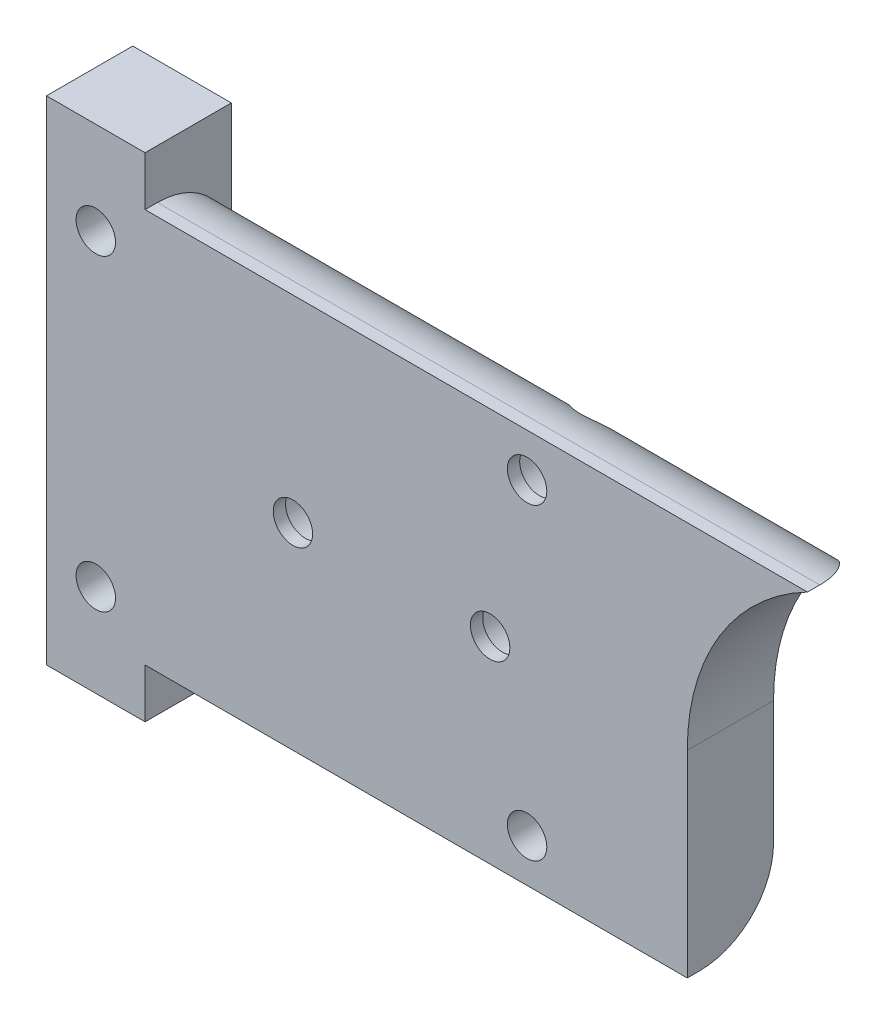
ISO-10303-21;
HEADER;
FILE_DESCRIPTION(('STEP AP214'),'2;1');
FILE_NAME('part.step','',(''),(''),'','','');
FILE_SCHEMA(('AUTOMOTIVE_DESIGN { 1 0 10303 214 1 1 1 1 }'));
ENDSEC;
DATA;
#1=APPLICATION_CONTEXT('core data for automotive mechanical design processes');
#2=APPLICATION_PROTOCOL_DEFINITION('international standard','automotive_design',2000,#1);
#3=PRODUCT_CONTEXT('',#1,'mechanical');
#4=PRODUCT('Part','Part','',(#3));
#5=PRODUCT_RELATED_PRODUCT_CATEGORY('part','',(#4));
#6=PRODUCT_DEFINITION_FORMATION('','',#4);
#7=PRODUCT_DEFINITION_CONTEXT('part definition',#1,'design');
#8=PRODUCT_DEFINITION('design','',#6,#7);
#9=PRODUCT_DEFINITION_SHAPE('','',#8);
#10=(LENGTH_UNIT() NAMED_UNIT(*) SI_UNIT(.MILLI.,.METRE.));
#11=(NAMED_UNIT(*) PLANE_ANGLE_UNIT() SI_UNIT($,.RADIAN.));
#12=(NAMED_UNIT(*) SI_UNIT($,.STERADIAN.) SOLID_ANGLE_UNIT());
#13=UNCERTAINTY_MEASURE_WITH_UNIT(LENGTH_MEASURE(1.E-05),#10,'distance_accuracy_value','');
#14=(GEOMETRIC_REPRESENTATION_CONTEXT(3) GLOBAL_UNCERTAINTY_ASSIGNED_CONTEXT((#13)) GLOBAL_UNIT_ASSIGNED_CONTEXT((#10,
#11,#12)) REPRESENTATION_CONTEXT('',''));
#15=CARTESIAN_POINT('',(0.,0.,0.));
#16=DIRECTION('',(0.,0.,1.));
#17=DIRECTION('',(1.,0.,0.));
#18=AXIS2_PLACEMENT_3D('',#15,#16,#17);
#19=CARTESIAN_POINT('',(0.,0.,0.));
#20=DIRECTION('',(0.,0.,1.));
#21=DIRECTION('',(1.,0.,0.));
#22=AXIS2_PLACEMENT_3D('',#19,#20,#21);
#23=PLANE('',#22);
#24=DIRECTION('',(0.,-1.,0.));
#25=VECTOR('',#24,1.);
#26=CARTESIAN_POINT('',(36.1612558937557,0.,0.));
#27=LINE('',#26,#25);
#28=CARTESIAN_POINT('',(36.1612558937557,0.,0.));
#29=VERTEX_POINT('',#28);
#30=CARTESIAN_POINT('',(36.1612558937557,-5.,0.));
#31=VERTEX_POINT('',#30);
#32=EDGE_CURVE('E301',#29,#31,#27,.T.);
#33=ORIENTED_EDGE('',*,*,#32,.T.);
#34=DIRECTION('',(1.,0.,0.));
#35=VECTOR('',#34,1.);
#36=CARTESIAN_POINT('',(0.,-5.,0.));
#37=LINE('',#36,#35);
#38=CARTESIAN_POINT('',(14.1612558936984,-5.,0.));
#39=VERTEX_POINT('',#38);
#40=EDGE_CURVE('E181',#31,#39,#37,.F.);
#41=ORIENTED_EDGE('',*,*,#40,.T.);
#42=DIRECTION('',(0.,1.,0.));
#43=VECTOR('',#42,1.);
#44=CARTESIAN_POINT('',(14.1612558936984,0.,0.));
#45=LINE('',#44,#43);
#46=CARTESIAN_POINT('',(14.1612558936984,-10.,0.));
#47=VERTEX_POINT('',#46);
#48=EDGE_CURVE('E305',#47,#39,#45,.T.);
#49=ORIENTED_EDGE('',*,*,#48,.F.);
#50=DIRECTION('',(1.,0.,0.));
#51=VECTOR('',#50,1.);
#52=CARTESIAN_POINT('',(0.,-10.,0.));
#53=LINE('',#52,#51);
#54=CARTESIAN_POINT('',(10.1612558936984,-10.,0.));
#55=VERTEX_POINT('',#54);
#56=EDGE_CURVE('E307',#55,#47,#53,.T.);
#57=ORIENTED_EDGE('',*,*,#56,.F.);
#58=DIRECTION('',(0.,-1.,0.));
#59=VECTOR('',#58,1.);
#60=CARTESIAN_POINT('',(10.1612558936984,0.,0.));
#61=LINE('',#60,#59);
#62=CARTESIAN_POINT('',(10.1612558936984,10.,0.));
#63=VERTEX_POINT('',#62);
#64=EDGE_CURVE('E151',#63,#55,#61,.T.);
#65=ORIENTED_EDGE('',*,*,#64,.F.);
#66=DIRECTION('',(1.,0.,0.));
#67=VECTOR('',#66,1.);
#68=CARTESIAN_POINT('',(0.,10.,0.));
#69=LINE('',#68,#67);
#70=CARTESIAN_POINT('',(14.1612558936984,10.,0.));
#71=VERTEX_POINT('',#70);
#72=EDGE_CURVE('E147',#63,#71,#69,.T.);
#73=ORIENTED_EDGE('',*,*,#72,.T.);
#74=DIRECTION('',(0.,-1.,0.));
#75=VECTOR('',#74,1.);
#76=CARTESIAN_POINT('',(14.1612558936984,0.,0.));
#77=LINE('',#76,#75);
#78=CARTESIAN_POINT('',(14.1612558936984,5.,0.));
#79=VERTEX_POINT('',#78);
#80=EDGE_CURVE('E265',#71,#79,#77,.T.);
#81=ORIENTED_EDGE('',*,*,#80,.T.);
#82=DIRECTION('',(1.,0.,0.));
#83=VECTOR('',#82,1.);
#84=CARTESIAN_POINT('',(41.0381502681381,5.,0.));
#85=LINE('',#84,#83);
#86=CARTESIAN_POINT('',(29.6612558937558,4.99999999999979,0.));
#87=VERTEX_POINT('',#86);
#88=EDGE_CURVE('E176',#79,#87,#85,.T.);
#89=ORIENTED_EDGE('',*,*,#88,.T.);
#90=DIRECTION('',(1.,0.,0.));
#91=VECTOR('',#90,1.);
#92=CARTESIAN_POINT('',(41.0381502681381,5.,0.));
#93=LINE('',#92,#91);
#94=CARTESIAN_POINT('',(37.6779411202078,5.,0.));
#95=VERTEX_POINT('',#94);
#96=EDGE_CURVE('E179',#87,#95,#93,.T.);
#97=ORIENTED_EDGE('',*,*,#96,.T.);
#98=CARTESIAN_POINT('',(45.1612558937557,0.,0.));
#99=DIRECTION('',(0.,0.,1.));
#100=DIRECTION('',(1.,0.,0.));
#101=AXIS2_PLACEMENT_3D('',#98,#99,#100);
#102=CIRCLE('',#101,9.);
#103=EDGE_CURVE('E271',#95,#29,#102,.T.);
#104=ORIENTED_EDGE('',*,*,#103,.T.);
#105=EDGE_LOOP('',(#33,#41,#49,#57,#65,#73,#81,#89,#97,#104));
#106=FACE_BOUND('',#105,.T.);
#107=CARTESIAN_POINT('',(12.1612558937557,6.25,0.));
#108=DIRECTION('',(0.,0.,1.));
#109=DIRECTION('',(1.,0.,0.));
#110=AXIS2_PLACEMENT_3D('',#107,#108,#109);
#111=CIRCLE('',#110,0.800000000000001);
#112=CARTESIAN_POINT('',(12.9612558937557,6.25,0.));
#113=VERTEX_POINT('',#112);
#114=EDGE_CURVE('E326',#113,#113,#111,.T.);
#115=ORIENTED_EDGE('',*,*,#114,.T.);
#116=EDGE_LOOP('',(#115));
#117=FACE_BOUND('',#116,.T.);
#118=CARTESIAN_POINT('',(12.1612558937557,-6.25,0.));
#119=DIRECTION('',(0.,0.,1.));
#120=DIRECTION('',(1.,0.,0.));
#121=AXIS2_PLACEMENT_3D('',#118,#119,#120);
#122=CIRCLE('',#121,0.800000000000001);
#123=CARTESIAN_POINT('',(12.9612558937557,-6.25,0.));
#124=VERTEX_POINT('',#123);
#125=EDGE_CURVE('E335',#124,#124,#122,.T.);
#126=ORIENTED_EDGE('',*,*,#125,.T.);
#127=EDGE_LOOP('',(#126));
#128=FACE_BOUND('',#127,.T.);
#129=CARTESIAN_POINT('',(20.1612558937557,0.,0.));
#130=DIRECTION('',(0.,0.,1.));
#131=DIRECTION('',(1.,0.,0.));
#132=AXIS2_PLACEMENT_3D('',#129,#130,#131);
#133=CIRCLE('',#132,1.25);
#134=CARTESIAN_POINT('',(21.4112558937557,0.,0.));
#135=VERTEX_POINT('',#134);
#136=EDGE_CURVE('E169',#135,#135,#133,.T.);
#137=ORIENTED_EDGE('',*,*,#136,.T.);
#138=EDGE_LOOP('',(#137));
#139=FACE_BOUND('',#138,.T.);
#140=CARTESIAN_POINT('',(28.1612558937557,0.,0.));
#141=DIRECTION('',(0.,0.,1.));
#142=DIRECTION('',(1.,0.,0.));
#143=AXIS2_PLACEMENT_3D('',#140,#141,#142);
#144=CIRCLE('',#143,1.25);
#145=CARTESIAN_POINT('',(29.4112558937557,0.,0.));
#146=VERTEX_POINT('',#145);
#147=EDGE_CURVE('E353',#146,#146,#144,.T.);
#148=ORIENTED_EDGE('',*,*,#147,.T.);
#149=EDGE_LOOP('',(#148));
#150=FACE_BOUND('',#149,.T.);
#151=ADVANCED_FACE('F35',(#106,#117,#128,#139,#150),#23,.F.);
#152=CARTESIAN_POINT('',(0.,0.,3.5));
#153=DIRECTION('',(0.,0.,1.));
#154=DIRECTION('',(1.,0.,0.));
#155=AXIS2_PLACEMENT_3D('',#152,#153,#154);
#156=PLANE('',#155);
#157=CARTESIAN_POINT('',(29.6612558937557,-6.25,3.5));
#158=DIRECTION('',(0.,0.,1.));
#159=DIRECTION('',(1.,0.,0.));
#160=AXIS2_PLACEMENT_3D('',#157,#158,#159);
#161=CIRCLE('',#160,0.800000000000002);
#162=CARTESIAN_POINT('',(30.4612558937557,-6.25,3.5));
#163=VERTEX_POINT('',#162);
#164=EDGE_CURVE('E224',#163,#163,#161,.T.);
#165=ORIENTED_EDGE('',*,*,#164,.F.);
#166=EDGE_LOOP('',(#165));
#167=FACE_BOUND('',#166,.T.);
#168=CARTESIAN_POINT('',(12.1612558937557,-6.25,3.5));
#169=DIRECTION('',(0.,0.,1.));
#170=DIRECTION('',(1.,0.,0.));
#171=AXIS2_PLACEMENT_3D('',#168,#169,#170);
#172=CIRCLE('',#171,0.800000000000001);
#173=CARTESIAN_POINT('',(12.9612558937557,-6.25,3.5));
#174=VERTEX_POINT('',#173);
#175=EDGE_CURVE('E334',#174,#174,#172,.T.);
#176=ORIENTED_EDGE('',*,*,#175,.F.);
#177=EDGE_LOOP('',(#176));
#178=FACE_BOUND('',#177,.T.);
#179=CARTESIAN_POINT('',(12.1612558937557,6.25,3.5));
#180=DIRECTION('',(0.,0.,1.));
#181=DIRECTION('',(1.,0.,0.));
#182=AXIS2_PLACEMENT_3D('',#179,#180,#181);
#183=CIRCLE('',#182,0.800000000000001);
#184=CARTESIAN_POINT('',(12.9612558937557,6.25,3.5));
#185=VERTEX_POINT('',#184);
#186=EDGE_CURVE('E312',#185,#185,#183,.T.);
#187=ORIENTED_EDGE('',*,*,#186,.F.);
#188=EDGE_LOOP('',(#187));
#189=FACE_BOUND('',#188,.T.);
#190=DIRECTION('',(0.,-1.,0.));
#191=VECTOR('',#190,1.);
#192=CARTESIAN_POINT('',(10.1612558936984,0.,3.5));
#193=LINE('',#192,#191);
#194=CARTESIAN_POINT('',(10.1612558936984,10.,3.5));
#195=VERTEX_POINT('',#194);
#196=CARTESIAN_POINT('',(10.1612558936984,-10.,3.5));
#197=VERTEX_POINT('',#196);
#198=EDGE_CURVE('E137',#195,#197,#193,.T.);
#199=ORIENTED_EDGE('',*,*,#198,.T.);
#200=DIRECTION('',(1.,0.,0.));
#201=VECTOR('',#200,1.);
#202=CARTESIAN_POINT('',(0.,-10.,3.5));
#203=LINE('',#202,#201);
#204=CARTESIAN_POINT('',(14.1612558936984,-10.,3.5));
#205=VERTEX_POINT('',#204);
#206=EDGE_CURVE('E126',#197,#205,#203,.T.);
#207=ORIENTED_EDGE('',*,*,#206,.T.);
#208=DIRECTION('',(0.,1.,0.));
#209=VECTOR('',#208,1.);
#210=CARTESIAN_POINT('',(14.1612558936984,0.,3.5));
#211=LINE('',#210,#209);
#212=CARTESIAN_POINT('',(14.1612558936984,-8.,3.5));
#213=VERTEX_POINT('',#212);
#214=EDGE_CURVE('E136',#205,#213,#211,.T.);
#215=ORIENTED_EDGE('',*,*,#214,.T.);
#216=DIRECTION('',(1.,0.,0.));
#217=VECTOR('',#216,1.);
#218=CARTESIAN_POINT('',(0.,-8.,3.5));
#219=LINE('',#218,#217);
#220=CARTESIAN_POINT('',(36.1612558937557,-8.,3.5));
#221=VERTEX_POINT('',#220);
#222=EDGE_CURVE('E296',#213,#221,#219,.T.);
#223=ORIENTED_EDGE('',*,*,#222,.T.);
#224=DIRECTION('',(0.,-1.,0.));
#225=VECTOR('',#224,1.);
#226=CARTESIAN_POINT('',(36.1612558937557,0.,3.5));
#227=LINE('',#226,#225);
#228=CARTESIAN_POINT('',(36.1612558937557,0.,3.5));
#229=VERTEX_POINT('',#228);
#230=EDGE_CURVE('E322',#229,#221,#227,.T.);
#231=ORIENTED_EDGE('',*,*,#230,.F.);
#232=CARTESIAN_POINT('',(45.1612558937557,0.,3.5));
#233=DIRECTION('',(0.,0.,1.));
#234=DIRECTION('',(1.,0.,0.));
#235=AXIS2_PLACEMENT_3D('',#232,#233,#234);
#236=CIRCLE('',#235,9.);
#237=CARTESIAN_POINT('',(41.0381502681381,8.,3.5));
#238=VERTEX_POINT('',#237);
#239=EDGE_CURVE('E319',#238,#229,#236,.T.);
#240=ORIENTED_EDGE('',*,*,#239,.F.);
#241=DIRECTION('',(1.,0.,0.));
#242=VECTOR('',#241,1.);
#243=CARTESIAN_POINT('',(0.,8.,3.5));
#244=LINE('',#243,#242);
#245=CARTESIAN_POINT('',(14.1612558936984,8.,3.5));
#246=VERTEX_POINT('',#245);
#247=EDGE_CURVE('E316',#246,#238,#244,.T.);
#248=ORIENTED_EDGE('',*,*,#247,.F.);
#249=DIRECTION('',(0.,-1.,0.));
#250=VECTOR('',#249,1.);
#251=CARTESIAN_POINT('',(14.1612558936984,0.,3.5));
#252=LINE('',#251,#250);
#253=CARTESIAN_POINT('',(14.1612558936984,10.,3.5));
#254=VERTEX_POINT('',#253);
#255=EDGE_CURVE('E314',#254,#246,#252,.T.);
#256=ORIENTED_EDGE('',*,*,#255,.F.);
#257=DIRECTION('',(1.,0.,0.));
#258=VECTOR('',#257,1.);
#259=CARTESIAN_POINT('',(0.,10.,3.5));
#260=LINE('',#259,#258);
#261=EDGE_CURVE('E145',#195,#254,#260,.T.);
#262=ORIENTED_EDGE('',*,*,#261,.F.);
#263=EDGE_LOOP('',(#199,#207,#215,#223,#231,#240,#248,#256,#262));
#264=FACE_BOUND('',#263,.T.);
#265=CARTESIAN_POINT('',(20.1612558937557,0.,3.5));
#266=DIRECTION('',(0.,0.,1.));
#267=DIRECTION('',(1.,0.,0.));
#268=AXIS2_PLACEMENT_3D('',#265,#266,#267);
#269=CIRCLE('',#268,0.799999999999999);
#270=CARTESIAN_POINT('',(20.9612558937557,0.,3.5));
#271=VERTEX_POINT('',#270);
#272=EDGE_CURVE('E329',#271,#271,#269,.T.);
#273=ORIENTED_EDGE('',*,*,#272,.F.);
#274=EDGE_LOOP('',(#273));
#275=FACE_BOUND('',#274,.T.);
#276=CARTESIAN_POINT('',(29.6612558937557,6.25,3.5));
#277=DIRECTION('',(0.,0.,1.));
#278=DIRECTION('',(1.,0.,0.));
#279=AXIS2_PLACEMENT_3D('',#276,#277,#278);
#280=CIRCLE('',#279,0.800000000000002);
#281=CARTESIAN_POINT('',(30.4612558937557,6.25,3.5));
#282=VERTEX_POINT('',#281);
#283=EDGE_CURVE('E338',#282,#282,#280,.T.);
#284=ORIENTED_EDGE('',*,*,#283,.F.);
#285=EDGE_LOOP('',(#284));
#286=FACE_BOUND('',#285,.T.);
#287=CARTESIAN_POINT('',(28.1612558937557,0.,3.5));
#288=DIRECTION('',(0.,0.,1.));
#289=DIRECTION('',(1.,0.,0.));
#290=AXIS2_PLACEMENT_3D('',#287,#288,#289);
#291=CIRCLE('',#290,0.799999999999999);
#292=CARTESIAN_POINT('',(28.9612558937557,0.,3.5));
#293=VERTEX_POINT('',#292);
#294=EDGE_CURVE('E164',#293,#293,#291,.T.);
#295=ORIENTED_EDGE('',*,*,#294,.F.);
#296=EDGE_LOOP('',(#295));
#297=FACE_BOUND('',#296,.T.);
#298=ADVANCED_FACE('F141',(#167,#178,#189,#264,#275,#286,#297),#156,.T.);
#299=CARTESIAN_POINT('',(10.1612558936984,0.,3.5));
#300=DIRECTION('',(1.,0.,0.));
#301=DIRECTION('',(0.,0.,-1.));
#302=AXIS2_PLACEMENT_3D('',#299,#300,#301);
#303=PLANE('',#302);
#304=ORIENTED_EDGE('',*,*,#64,.T.);
#305=DIRECTION('',(0.,0.,-1.));
#306=VECTOR('',#305,1.);
#307=CARTESIAN_POINT('',(10.1612558936984,-10.,3.5));
#308=LINE('',#307,#306);
#309=EDGE_CURVE('E130',#197,#55,#308,.T.);
#310=ORIENTED_EDGE('',*,*,#309,.F.);
#311=ORIENTED_EDGE('',*,*,#198,.F.);
#312=DIRECTION('',(0.,0.,-1.));
#313=VECTOR('',#312,1.);
#314=CARTESIAN_POINT('',(10.1612558936984,10.,3.5));
#315=LINE('',#314,#313);
#316=EDGE_CURVE('E279',#195,#63,#315,.T.);
#317=ORIENTED_EDGE('',*,*,#316,.T.);
#318=EDGE_LOOP('',(#304,#310,#311,#317));
#319=FACE_BOUND('',#318,.T.);
#320=ADVANCED_FACE('F149',(#319),#303,.F.);
#321=CARTESIAN_POINT('',(0.,-10.,3.5));
#322=DIRECTION('',(0.,1.,0.));
#323=DIRECTION('',(0.,0.,1.));
#324=AXIS2_PLACEMENT_3D('',#321,#322,#323);
#325=PLANE('',#324);
#326=ORIENTED_EDGE('',*,*,#56,.T.);
#327=DIRECTION('',(0.,0.,-1.));
#328=VECTOR('',#327,1.);
#329=CARTESIAN_POINT('',(14.1612558936984,-10.,3.5));
#330=LINE('',#329,#328);
#331=EDGE_CURVE('E133',#205,#47,#330,.T.);
#332=ORIENTED_EDGE('',*,*,#331,.F.);
#333=ORIENTED_EDGE('',*,*,#206,.F.);
#334=ORIENTED_EDGE('',*,*,#309,.T.);
#335=EDGE_LOOP('',(#326,#332,#333,#334));
#336=FACE_BOUND('',#335,.T.);
#337=ADVANCED_FACE('F128',(#336),#325,.F.);
#338=CARTESIAN_POINT('',(14.1612558936984,0.,3.5));
#339=DIRECTION('',(-1.,0.,0.));
#340=DIRECTION('',(0.,0.,1.));
#341=AXIS2_PLACEMENT_3D('',#338,#339,#340);
#342=PLANE('',#341);
#343=ORIENTED_EDGE('',*,*,#48,.T.);
#344=CARTESIAN_POINT('',(14.1612558936984,-5.,3.));
#345=DIRECTION('',(-1.,0.,0.));
#346=DIRECTION('',(0.,0.,1.));
#347=AXIS2_PLACEMENT_3D('',#344,#345,#346);
#348=CIRCLE('',#347,3.);
#349=CARTESIAN_POINT('',(14.1612558936984,-8.,3.));
#350=VERTEX_POINT('',#349);
#351=EDGE_CURVE('E48',#39,#350,#348,.T.);
#352=ORIENTED_EDGE('',*,*,#351,.T.);
#353=DIRECTION('',(0.,0.,-1.));
#354=VECTOR('',#353,1.);
#355=CARTESIAN_POINT('',(14.1612558936984,-8.,3.5));
#356=LINE('',#355,#354);
#357=EDGE_CURVE('E157',#213,#350,#356,.T.);
#358=ORIENTED_EDGE('',*,*,#357,.F.);
#359=ORIENTED_EDGE('',*,*,#214,.F.);
#360=ORIENTED_EDGE('',*,*,#331,.T.);
#361=EDGE_LOOP('',(#343,#352,#358,#359,#360));
#362=FACE_BOUND('',#361,.T.);
#363=ADVANCED_FACE('F206',(#362),#342,.F.);
#364=CARTESIAN_POINT('',(0.,-8.,3.5));
#365=DIRECTION('',(0.,1.,0.));
#366=DIRECTION('',(0.,0.,1.));
#367=AXIS2_PLACEMENT_3D('',#364,#365,#366);
#368=PLANE('',#367);
#369=ORIENTED_EDGE('',*,*,#357,.T.);
#370=DIRECTION('',(1.,0.,0.));
#371=VECTOR('',#370,1.);
#372=CARTESIAN_POINT('',(0.,-8.,3.));
#373=LINE('',#372,#371);
#374=CARTESIAN_POINT('',(36.1612558937557,-8.,3.));
#375=VERTEX_POINT('',#374);
#376=EDGE_CURVE('E152',#350,#375,#373,.T.);
#377=ORIENTED_EDGE('',*,*,#376,.T.);
#378=DIRECTION('',(0.,0.,-1.));
#379=VECTOR('',#378,1.);
#380=CARTESIAN_POINT('',(36.1612558937557,-8.,3.5));
#381=LINE('',#380,#379);
#382=EDGE_CURVE('E289',#221,#375,#381,.T.);
#383=ORIENTED_EDGE('',*,*,#382,.F.);
#384=ORIENTED_EDGE('',*,*,#222,.F.);
#385=EDGE_LOOP('',(#369,#377,#383,#384));
#386=FACE_BOUND('',#385,.T.);
#387=ADVANCED_FACE('F202',(#386),#368,.F.);
#388=CARTESIAN_POINT('',(36.1612558937557,0.,3.5));
#389=DIRECTION('',(1.,0.,0.));
#390=DIRECTION('',(0.,0.,-1.));
#391=AXIS2_PLACEMENT_3D('',#388,#389,#390);
#392=PLANE('',#391);
#393=ORIENTED_EDGE('',*,*,#382,.T.);
#394=CARTESIAN_POINT('',(36.1612558937557,-5.,3.));
#395=DIRECTION('',(1.,0.,0.));
#396=DIRECTION('',(0.,0.,-1.));
#397=AXIS2_PLACEMENT_3D('',#394,#395,#396);
#398=CIRCLE('',#397,3.);
#399=EDGE_CURVE('E155',#375,#31,#398,.T.);
#400=ORIENTED_EDGE('',*,*,#399,.T.);
#401=ORIENTED_EDGE('',*,*,#32,.F.);
#402=DIRECTION('',(0.,0.,-1.));
#403=VECTOR('',#402,1.);
#404=CARTESIAN_POINT('',(36.1612558937557,0.,3.5));
#405=LINE('',#404,#403);
#406=EDGE_CURVE('E286',#229,#29,#405,.T.);
#407=ORIENTED_EDGE('',*,*,#406,.F.);
#408=ORIENTED_EDGE('',*,*,#230,.T.);
#409=EDGE_LOOP('',(#393,#400,#401,#407,#408));
#410=FACE_BOUND('',#409,.T.);
#411=ADVANCED_FACE('F197',(#410),#392,.T.);
#412=CARTESIAN_POINT('',(45.1612558937557,0.,3.5));
#413=DIRECTION('',(0.,0.,-1.));
#414=DIRECTION('',(-1.,0.,0.));
#415=AXIS2_PLACEMENT_3D('',#412,#413,#414);
#416=CYLINDRICAL_SURFACE('',#415,9.);
#417=ORIENTED_EDGE('',*,*,#103,.F.);
#418=CARTESIAN_POINT('',(37.6779411202078,5.,0.));
#419=CARTESIAN_POINT('',(37.7490721288445,5.10650141882249,8.68453722216579E-06));
#420=CARTESIAN_POINT('',(37.8224667223299,5.21138732180312,0.00566868097180427));
#421=CARTESIAN_POINT('',(37.9730043989282,5.41711632821926,0.0273401863324147));
#422=CARTESIAN_POINT('',(38.0501420361208,5.51796493733904,0.0433370500188986));
#423=CARTESIAN_POINT('',(38.2072959020681,5.71474166256061,0.0846586440683997));
#424=CARTESIAN_POINT('',(38.2873002109542,5.81068686096595,0.109948059588385));
#425=CARTESIAN_POINT('',(38.4498618642952,5.99771155689922,0.169064685641142));
#426=CARTESIAN_POINT('',(38.5324203318345,6.08878886455176,0.202895700182832));
#427=CARTESIAN_POINT('',(38.7157043964277,6.28299199808021,0.285751741612574));
#428=CARTESIAN_POINT('',(38.8168407630793,6.3850165719515,0.336452099527655));
#429=CARTESIAN_POINT('',(39.0208291289957,6.58142946574406,0.448167002830555));
#430=CARTESIAN_POINT('',(39.1236814811498,6.67581619101478,0.509183693917048));
#431=CARTESIAN_POINT('',(39.3301951673238,6.85694036515275,0.641112070528136));
#432=CARTESIAN_POINT('',(39.4338576824066,6.94366264394014,0.712042692875107));
#433=CARTESIAN_POINT('',(39.6404989956468,7.10905974943313,0.863543084787923));
#434=CARTESIAN_POINT('',(39.7434780684749,7.18773801836021,0.944108699018686));
#435=CARTESIAN_POINT('',(39.9084575742003,7.30850559351465,1.08277466673553));
#436=CARTESIAN_POINT('',(39.9711851705781,7.35315340206941,1.13780462539428));
#437=CARTESIAN_POINT('',(40.0951900610272,7.43913049701664,1.25193014453705));
#438=CARTESIAN_POINT('',(40.1564676560231,7.48046047630734,1.31102485132385));
#439=CARTESIAN_POINT('',(40.2767571392235,7.5595529151624,1.43347748668312));
#440=CARTESIAN_POINT('',(40.3357732822705,7.59732229148899,1.49682672244467));
#441=CARTESIAN_POINT('',(40.4506645854319,7.66908836080768,1.62829608889235));
#442=CARTESIAN_POINT('',(40.5065411339808,7.70308672805059,1.6964140802595));
#443=CARTESIAN_POINT('',(40.6255896193802,7.77389861953861,1.85349867450895));
#444=CARTESIAN_POINT('',(40.6876798347693,7.80969840747209,1.94376436932076));
#445=CARTESIAN_POINT('',(40.8014681415121,7.87378602016624,2.13321591169925));
#446=CARTESIAN_POINT('',(40.8531785064462,7.90208272975439,2.23239102102542));
#447=CARTESIAN_POINT('',(40.9299235366892,7.94337774436603,2.41436406834142));
#448=CARTESIAN_POINT('',(40.9583897841233,7.95842559538483,2.49522262088802));
#449=CARTESIAN_POINT('',(41.0032479918641,7.98195663420023,2.66105980854418));
#450=CARTESIAN_POINT('',(41.0196792609159,7.99046119836649,2.74602405544007));
#451=CARTESIAN_POINT('',(41.0320463448745,7.99685154955072,2.85974853423063));
#452=CARTESIAN_POINT('',(41.0343298385149,7.9980299882842,2.88772577928064));
#453=CARTESIAN_POINT('',(41.037381949105,7.99960419187983,2.94379799628335));
#454=CARTESIAN_POINT('',(41.0381498421193,7.99999958271495,2.97189301807533));
#455=CARTESIAN_POINT('',(41.0381502681381,8.,3.));
#456=B_SPLINE_CURVE_WITH_KNOTS('',3,(#418,#419,#420,#421,#422,#423,#424,#425,#426,#427,#428,
#429,#430,#431,#432,#433,#434,#435,#436,#437,#438,#439,#440,#441,#442,#443,#444,#445,#446,#447,
#448,#449,#450,#451,#452,#453,#454,#455),.UNSPECIFIED.,.F.,.F.,(4,2,2,2,2,2,2,2,2,2,2,2,2,2,2,2,
2,2,4),(0.,0.383934366881736,0.767325965950373,1.14927536712455,1.53139517078649,
1.98782438742064,2.44434865401615,2.90175716798174,3.35896911951587,3.64275330368879,
3.92647806711659,4.20963979653154,4.49267530041665,4.83768761032372,5.18228952805237,
5.4424767429303,5.70181029566204,5.7860544217949,5.87033877789053),.UNSPECIFIED.);
#457=CARTESIAN_POINT('',(41.0381502681381,8.,3.));
#458=VERTEX_POINT('',#457);
#459=EDGE_CURVE('E184',#95,#458,#456,.T.);
#460=ORIENTED_EDGE('',*,*,#459,.T.);
#461=DIRECTION('',(0.,0.,-1.));
#462=VECTOR('',#461,1.);
#463=CARTESIAN_POINT('',(41.0381502681381,8.,3.5));
#464=LINE('',#463,#462);
#465=EDGE_CURVE('E284',#238,#458,#464,.T.);
#466=ORIENTED_EDGE('',*,*,#465,.F.);
#467=ORIENTED_EDGE('',*,*,#239,.T.);
#468=ORIENTED_EDGE('',*,*,#406,.T.);
#469=EDGE_LOOP('',(#417,#460,#466,#467,#468));
#470=FACE_BOUND('',#469,.T.);
#471=ADVANCED_FACE('F191',(#470),#416,.F.);
#472=CARTESIAN_POINT('',(0.,8.,3.5));
#473=DIRECTION('',(0.,1.,0.));
#474=DIRECTION('',(0.,0.,1.));
#475=AXIS2_PLACEMENT_3D('',#472,#473,#474);
#476=PLANE('',#475);
#477=ORIENTED_EDGE('',*,*,#465,.T.);
#478=DIRECTION('',(1.,0.,0.));
#479=VECTOR('',#478,1.);
#480=CARTESIAN_POINT('',(14.1612558936984,8.,3.));
#481=LINE('',#480,#479);
#482=CARTESIAN_POINT('',(14.1612558936984,8.,3.));
#483=VERTEX_POINT('',#482);
#484=EDGE_CURVE('E60',#458,#483,#481,.F.);
#485=ORIENTED_EDGE('',*,*,#484,.T.);
#486=DIRECTION('',(0.,0.,-1.));
#487=VECTOR('',#486,1.);
#488=CARTESIAN_POINT('',(14.1612558936984,8.,3.5));
#489=LINE('',#488,#487);
#490=EDGE_CURVE('E282',#246,#483,#489,.T.);
#491=ORIENTED_EDGE('',*,*,#490,.F.);
#492=ORIENTED_EDGE('',*,*,#247,.T.);
#493=EDGE_LOOP('',(#477,#485,#491,#492));
#494=FACE_BOUND('',#493,.T.);
#495=ADVANCED_FACE('F196',(#494),#476,.T.);
#496=CARTESIAN_POINT('',(14.1612558936984,0.,3.5));
#497=DIRECTION('',(1.,0.,0.));
#498=DIRECTION('',(0.,0.,-1.));
#499=AXIS2_PLACEMENT_3D('',#496,#497,#498);
#500=PLANE('',#499);
#501=ORIENTED_EDGE('',*,*,#80,.F.);
#502=DIRECTION('',(0.,0.,-1.));
#503=VECTOR('',#502,1.);
#504=CARTESIAN_POINT('',(14.1612558936984,10.,3.5));
#505=LINE('',#504,#503);
#506=EDGE_CURVE('E268',#254,#71,#505,.T.);
#507=ORIENTED_EDGE('',*,*,#506,.F.);
#508=ORIENTED_EDGE('',*,*,#255,.T.);
#509=ORIENTED_EDGE('',*,*,#490,.T.);
#510=CARTESIAN_POINT('',(14.1612558936984,5.,3.));
#511=DIRECTION('',(1.,0.,0.));
#512=DIRECTION('',(0.,0.,-1.));
#513=AXIS2_PLACEMENT_3D('',#510,#511,#512);
#514=CIRCLE('',#513,3.);
#515=EDGE_CURVE('E11',#483,#79,#514,.F.);
#516=ORIENTED_EDGE('',*,*,#515,.T.);
#517=EDGE_LOOP('',(#501,#507,#508,#509,#516));
#518=FACE_BOUND('',#517,.T.);
#519=ADVANCED_FACE('F257',(#518),#500,.T.);
#520=CARTESIAN_POINT('',(0.,10.,3.5));
#521=DIRECTION('',(0.,1.,0.));
#522=DIRECTION('',(0.,0.,1.));
#523=AXIS2_PLACEMENT_3D('',#520,#521,#522);
#524=PLANE('',#523);
#525=ORIENTED_EDGE('',*,*,#72,.F.);
#526=ORIENTED_EDGE('',*,*,#316,.F.);
#527=ORIENTED_EDGE('',*,*,#261,.T.);
#528=ORIENTED_EDGE('',*,*,#506,.T.);
#529=EDGE_LOOP('',(#525,#526,#527,#528));
#530=FACE_BOUND('',#529,.T.);
#531=ADVANCED_FACE('F248',(#530),#524,.T.);
#532=CARTESIAN_POINT('',(12.1612558937557,6.25,3.5));
#533=DIRECTION('',(0.,0.,-1.));
#534=DIRECTION('',(-1.,0.,0.));
#535=AXIS2_PLACEMENT_3D('',#532,#533,#534);
#536=CYLINDRICAL_SURFACE('',#535,0.800000000000001);
#537=ORIENTED_EDGE('',*,*,#186,.T.);
#538=EDGE_LOOP('',(#537));
#539=FACE_BOUND('',#538,.T.);
#540=ORIENTED_EDGE('',*,*,#114,.F.);
#541=EDGE_LOOP('',(#540));
#542=FACE_BOUND('',#541,.T.);
#543=ADVANCED_FACE('F244',(#539,#542),#536,.F.);
#544=CARTESIAN_POINT('',(20.1612558937557,0.,3.5));
#545=DIRECTION('',(0.,0.,-1.));
#546=DIRECTION('',(-1.,0.,0.));
#547=AXIS2_PLACEMENT_3D('',#544,#545,#546);
#548=CYLINDRICAL_SURFACE('',#547,0.799999999999999);
#549=CARTESIAN_POINT('',(20.1612558937557,0.,3.));
#550=DIRECTION('',(0.,0.,1.));
#551=DIRECTION('',(1.,0.,0.));
#552=AXIS2_PLACEMENT_3D('',#549,#550,#551);
#553=CIRCLE('',#552,0.799999999999999);
#554=CARTESIAN_POINT('',(20.9612558937557,0.,3.));
#555=VERTEX_POINT('',#554);
#556=EDGE_CURVE('E161',#555,#555,#553,.T.);
#557=ORIENTED_EDGE('',*,*,#556,.F.);
#558=EDGE_LOOP('',(#557));
#559=FACE_BOUND('',#558,.T.);
#560=ORIENTED_EDGE('',*,*,#272,.T.);
#561=EDGE_LOOP('',(#560));
#562=FACE_BOUND('',#561,.T.);
#563=ADVANCED_FACE('F240',(#559,#562),#548,.F.);
#564=CARTESIAN_POINT('',(12.1612558937557,-6.25,3.5));
#565=DIRECTION('',(0.,0.,-1.));
#566=DIRECTION('',(-1.,0.,0.));
#567=AXIS2_PLACEMENT_3D('',#564,#565,#566);
#568=CYLINDRICAL_SURFACE('',#567,0.800000000000001);
#569=ORIENTED_EDGE('',*,*,#175,.T.);
#570=EDGE_LOOP('',(#569));
#571=FACE_BOUND('',#570,.T.);
#572=ORIENTED_EDGE('',*,*,#125,.F.);
#573=EDGE_LOOP('',(#572));
#574=FACE_BOUND('',#573,.T.);
#575=ADVANCED_FACE('F236',(#571,#574),#568,.F.);
#576=CARTESIAN_POINT('',(29.6612558937557,6.25,3.5));
#577=DIRECTION('',(0.,0.,-1.));
#578=DIRECTION('',(-1.,0.,0.));
#579=AXIS2_PLACEMENT_3D('',#576,#577,#578);
#580=CYLINDRICAL_SURFACE('',#579,0.800000000000002);
#581=CARTESIAN_POINT('',(29.6612558937557,6.25,3.));
#582=DIRECTION('',(0.,0.,1.));
#583=DIRECTION('',(1.,0.,0.));
#584=AXIS2_PLACEMENT_3D('',#581,#582,#583);
#585=CIRCLE('',#584,0.800000000000002);
#586=CARTESIAN_POINT('',(30.4612558937557,6.25,3.));
#587=VERTEX_POINT('',#586);
#588=EDGE_CURVE('E166',#587,#587,#585,.T.);
#589=ORIENTED_EDGE('',*,*,#588,.F.);
#590=EDGE_LOOP('',(#589));
#591=FACE_BOUND('',#590,.T.);
#592=ORIENTED_EDGE('',*,*,#283,.T.);
#593=EDGE_LOOP('',(#592));
#594=FACE_BOUND('',#593,.T.);
#595=ADVANCED_FACE('F231',(#591,#594),#580,.F.);
#596=CARTESIAN_POINT('',(29.6612558937557,-6.25,3.5));
#597=DIRECTION('',(0.,0.,-1.));
#598=DIRECTION('',(-1.,0.,0.));
#599=AXIS2_PLACEMENT_3D('',#596,#597,#598);
#600=CYLINDRICAL_SURFACE('',#599,0.800000000000002);
#601=ORIENTED_EDGE('',*,*,#164,.T.);
#602=EDGE_LOOP('',(#601));
#603=FACE_BOUND('',#602,.T.);
#604=CARTESIAN_POINT('',(28.8669898601777,-6.1543889760288,0.230995469121816));
#605=CARTESIAN_POINT('',(28.8610424034426,-6.20379845503655,0.251594932937657));
#606=CARTESIAN_POINT('',(28.8597924454556,-6.25312919157187,0.273729157216539));
#607=CARTESIAN_POINT('',(28.8660494192606,-6.35004620753061,0.320396459576226));
#608=CARTESIAN_POINT('',(28.873559997411,-6.39763175205505,0.344930532640132));
#609=CARTESIAN_POINT('',(28.8965400789899,-6.48968971234962,0.395471117182172));
#610=CARTESIAN_POINT('',(28.9119728861916,-6.53417541701942,0.421470351901532));
#611=CARTESIAN_POINT('',(28.9501484529753,-6.61947566827181,0.474170252649965));
#612=CARTESIAN_POINT('',(28.9728969607803,-6.66028729560993,0.500871455041952));
#613=CARTESIAN_POINT('',(29.0277269546488,-6.74117399629163,0.556449076327461));
#614=CARTESIAN_POINT('',(29.0604881072622,-6.78081357811957,0.585292118780582));
#615=CARTESIAN_POINT('',(29.1339005224362,-6.85379567240257,0.640860836011702));
#616=CARTESIAN_POINT('',(29.1745423893968,-6.88714559107845,0.667588979320876));
#617=CARTESIAN_POINT('',(29.2501447583423,-6.93730335957757,0.709239388423217));
#618=CARTESIAN_POINT('',(29.2831753067048,-6.9560766362608,0.725303151431331));
#619=CARTESIAN_POINT('',(29.3527374659773,-6.98911601912967,0.754137711333005));
#620=CARTESIAN_POINT('',(29.3892628172819,-7.00338999415987,0.766914249989781));
#621=CARTESIAN_POINT('',(29.4590825226101,-7.02474847105631,0.786277217069723));
#622=CARTESIAN_POINT('',(29.4919483067491,-7.03262108503241,0.793529554958496));
#623=CARTESIAN_POINT('',(29.5590157312166,-7.04416736736232,0.80422148251666));
#624=CARTESIAN_POINT('',(29.5932164117956,-7.047843997016,0.807663761069026));
#625=CARTESIAN_POINT('',(29.6620665761564,-7.05074297118491,0.810374935151067));
#626=CARTESIAN_POINT('',(29.6967170001741,-7.0499536345233,0.809632886175038));
#627=CARTESIAN_POINT('',(29.7652923474646,-7.04395364994836,0.804033434616454));
#628=CARTESIAN_POINT('',(29.7992170196624,-7.03874149652407,0.799174630706144));
#629=CARTESIAN_POINT('',(29.8643615699409,-7.02448417415015,0.786055002301203));
#630=CARTESIAN_POINT('',(29.8956332119246,-7.01556660590359,0.777907667632942));
#631=CARTESIAN_POINT('',(29.9561214575928,-6.99436782120505,0.758861900223405));
#632=CARTESIAN_POINT('',(29.985336697509,-6.98208439851008,0.747961663384093));
#633=CARTESIAN_POINT('',(30.0546354445597,-6.94811371763511,0.718429046583913));
#634=CARTESIAN_POINT('',(30.0933639279437,-6.92472128943083,0.698571857441299));
#635=CARTESIAN_POINT('',(30.1654239675531,-6.87273278349172,0.656071043811953));
#636=CARTESIAN_POINT('',(30.1987460358119,-6.84412774069548,0.633422640843512));
#637=CARTESIAN_POINT('',(30.2603813265937,-6.78197419722205,0.586265110921498));
#638=CARTESIAN_POINT('',(30.2885941096948,-6.7483463080516,0.561729916124192));
#639=CARTESIAN_POINT('',(30.3390594754824,-6.67718320974228,0.512242523455414));
#640=CARTESIAN_POINT('',(30.3613124938444,-6.63964828649718,0.487290356207538));
#641=CARTESIAN_POINT('',(30.402859045427,-6.55437930232853,0.433511794359169));
#642=CARTESIAN_POINT('',(30.4209646221613,-6.50600680465428,0.404766409749804));
#643=CARTESIAN_POINT('',(30.4476765461378,-6.40567746559746,0.349083124494894));
#644=CARTESIAN_POINT('',(30.4562808088119,-6.35371984030109,0.322145621711892));
#645=CARTESIAN_POINT('',(30.4628952909849,-6.2495594776037,0.272029638827439));
#646=CARTESIAN_POINT('',(30.4612639135932,-6.19742825102557,0.248752938762853));
#647=CARTESIAN_POINT('',(30.4474796602482,-6.09312308904317,0.205674540801505));
#648=CARTESIAN_POINT('',(30.4353385507481,-6.0409492665683,0.185868986498015));
#649=CARTESIAN_POINT('',(30.402445771141,-5.94524824917375,0.152412065901813));
#650=CARTESIAN_POINT('',(30.3829454807265,-5.90144998801459,0.138302433865513));
#651=CARTESIAN_POINT('',(30.3359275402608,-5.81741282145495,0.113175090830199));
#652=CARTESIAN_POINT('',(30.3084141212096,-5.77717205224761,0.102155754140671));
#653=CARTESIAN_POINT('',(30.2488795709461,-5.70531541306114,0.0838747349619348));
#654=CARTESIAN_POINT('',(30.2174721565794,-5.67325152888547,0.0763669427471245));
#655=CARTESIAN_POINT('',(30.1494790086812,-5.61466498115104,0.0634904765861361));
#656=CARTESIAN_POINT('',(30.1128941417087,-5.58814139213927,0.0581214452443969));
#657=CARTESIAN_POINT('',(30.0365826070375,-5.54213960448992,0.0493014373478479));
#658=CARTESIAN_POINT('',(29.9969562898011,-5.52250307111408,0.0458062176521249));
#659=CARTESIAN_POINT('',(29.9149242380622,-5.49000088253871,0.0402411492616802));
#660=CARTESIAN_POINT('',(29.8725185069916,-5.47713521897896,0.0381712988070056));
#661=CARTESIAN_POINT('',(29.786022283466,-5.45854878945954,0.0352364727829855));
#662=CARTESIAN_POINT('',(29.7419279689296,-5.45284535688398,0.0343744196349854));
#663=CARTESIAN_POINT('',(29.6533948878301,-5.44881220540182,0.0337613166882123));
#664=CARTESIAN_POINT('',(29.6089561119701,-5.45048268621411,0.0340102969812479));
#665=CARTESIAN_POINT('',(29.520839625256,-5.46116579564831,0.035652693812013));
#666=CARTESIAN_POINT('',(29.4771649573884,-5.47020296504543,0.0370499357003051));
#667=CARTESIAN_POINT('',(29.3919751161651,-5.49537398736023,0.0411546312082521));
#668=CARTESIAN_POINT('',(29.3504599169482,-5.5115077552692,0.0438620691333755));
#669=CARTESIAN_POINT('',(29.2708466072236,-5.55032981122172,0.0508436121730852));
#670=CARTESIAN_POINT('',(29.232742782855,-5.57300685993581,0.0551150342030817));
#671=CARTESIAN_POINT('',(29.1609626571159,-5.62418126997954,0.0655363125725843));
#672=CARTESIAN_POINT('',(29.1272858545095,-5.65267797146267,0.0716859559938715));
#673=CARTESIAN_POINT('',(29.0654244149088,-5.71438400202104,0.0861276716603398));
#674=CARTESIAN_POINT('',(29.0372154768484,-5.74757129014838,0.0944098647656229));
#675=CARTESIAN_POINT('',(28.9867888069236,-5.81761414909142,0.113337158825398));
#676=CARTESIAN_POINT('',(28.9645716581096,-5.85447007641863,0.123982489549089));
#677=CARTESIAN_POINT('',(28.9246959048921,-5.93431424427098,0.148865985052005));
#678=CARTESIAN_POINT('',(28.9076877323553,-5.97755063192391,0.16335235695328));
#679=CARTESIAN_POINT('',(28.8815098044776,-6.06534170614424,0.195141558598667));
#680=CARTESIAN_POINT('',(28.8723453614189,-6.10989726504352,0.212446287690413));
#681=CARTESIAN_POINT('',(28.8669898601777,-6.1543889760288,0.230995469121816));
#682=B_SPLINE_CURVE_WITH_KNOTS('',3,(#604,#605,#606,#607,#608,#609,#610,#611,#612,#613,#614,
#615,#616,#617,#618,#619,#620,#621,#622,#623,#624,#625,#626,#627,#628,#629,#630,#631,#632,#633,
#634,#635,#636,#637,#638,#639,#640,#641,#642,#643,#644,#645,#646,#647,#648,#649,#650,#651,#652,
#653,#654,#655,#656,#657,#658,#659,#660,#661,#662,#663,#664,#665,#666,#667,#668,#669,#670,#671,
#672,#673,#674,#675,#676,#677,#678,#679,#680,#681),.UNSPECIFIED.,.T.,.F.,(4,2,2,2,2,2,2,2,2,2,2,
2,2,2,2,2,2,2,2,2,2,2,2,2,2,2,2,2,2,2,2,2,2,2,2,2,2,2,4),(0.,0.161385587919175,
0.322838372607933,0.483549957760158,0.644388129892265,0.820452689434529,0.996308616546508,
1.11962842416265,1.24273134506681,1.34598605155366,1.44916784127598,1.55261963773381,
1.6561066629446,1.7562918665338,1.85654289704394,2.00396902326815,2.15165113948499,
2.30197925045348,2.45229636901773,2.62875846467067,2.80525926804714,2.97561518558345,
3.14578062288721,3.29488965329979,3.4439200951714,3.57977259164959,3.7156023770955,
3.84806542982868,3.98052831900484,4.11331116893451,4.24609761524591,4.37932823189148,
4.51255725263821,4.64555877581352,4.77854522731342,4.91092636205461,5.04332037393007,
5.1885448374462,5.33386757873155),.UNSPECIFIED.);
#683=CARTESIAN_POINT('',(28.8669898601777,-6.1543889760288,0.230995469121816));
#684=VERTEX_POINT('',#683);
#685=EDGE_CURVE('E219',#684,#684,#682,.T.);
#686=ORIENTED_EDGE('',*,*,#685,.F.);
#687=EDGE_LOOP('',(#686));
#688=FACE_BOUND('',#687,.T.);
#689=ADVANCED_FACE('F225',(#603,#688),#600,.F.);
#690=CARTESIAN_POINT('',(28.1612558937557,0.,3.5));
#691=DIRECTION('',(0.,0.,-1.));
#692=DIRECTION('',(-1.,0.,0.));
#693=AXIS2_PLACEMENT_3D('',#690,#691,#692);
#694=CYLINDRICAL_SURFACE('',#693,0.799999999999999);
#695=CARTESIAN_POINT('',(28.1612558937557,0.,3.));
#696=DIRECTION('',(0.,0.,1.));
#697=DIRECTION('',(1.,0.,0.));
#698=AXIS2_PLACEMENT_3D('',#695,#696,#697);
#699=CIRCLE('',#698,0.799999999999999);
#700=CARTESIAN_POINT('',(28.9612558937557,0.,3.));
#701=VERTEX_POINT('',#700);
#702=EDGE_CURVE('E171',#701,#701,#699,.T.);
#703=ORIENTED_EDGE('',*,*,#702,.F.);
#704=EDGE_LOOP('',(#703));
#705=FACE_BOUND('',#704,.T.);
#706=ORIENTED_EDGE('',*,*,#294,.T.);
#707=EDGE_LOOP('',(#706));
#708=FACE_BOUND('',#707,.T.);
#709=ADVANCED_FACE('F230',(#705,#708),#694,.F.);
#710=CARTESIAN_POINT('',(20.1612558937557,0.,3.));
#711=DIRECTION('',(0.,0.,-1.));
#712=DIRECTION('',(-1.,0.,0.));
#713=AXIS2_PLACEMENT_3D('',#710,#711,#712);
#714=CYLINDRICAL_SURFACE('',#713,1.25);
#715=CARTESIAN_POINT('',(20.1612558937557,0.,3.));
#716=DIRECTION('',(0.,0.,1.));
#717=DIRECTION('',(1.,0.,0.));
#718=AXIS2_PLACEMENT_3D('',#715,#716,#717);
#719=CIRCLE('',#718,1.25);
#720=CARTESIAN_POINT('',(21.4112558937557,0.,3.));
#721=VERTEX_POINT('',#720);
#722=EDGE_CURVE('E165',#721,#721,#719,.T.);
#723=ORIENTED_EDGE('',*,*,#722,.T.);
#724=EDGE_LOOP('',(#723));
#725=FACE_BOUND('',#724,.T.);
#726=ORIENTED_EDGE('',*,*,#136,.F.);
#727=EDGE_LOOP('',(#726));
#728=FACE_BOUND('',#727,.T.);
#729=ADVANCED_FACE('F380',(#725,#728),#714,.F.);
#730=CARTESIAN_POINT('',(20.1612558937557,0.,3.));
#731=DIRECTION('',(0.,0.,1.));
#732=DIRECTION('',(1.,0.,0.));
#733=AXIS2_PLACEMENT_3D('',#730,#731,#732);
#734=PLANE('',#733);
#735=ORIENTED_EDGE('',*,*,#556,.T.);
#736=EDGE_LOOP('',(#735));
#737=FACE_BOUND('',#736,.T.);
#738=ORIENTED_EDGE('',*,*,#722,.F.);
#739=EDGE_LOOP('',(#738));
#740=FACE_BOUND('',#739,.T.);
#741=ADVANCED_FACE('F377',(#737,#740),#734,.F.);
#742=CARTESIAN_POINT('',(29.6612558937557,6.25,3.));
#743=DIRECTION('',(0.,0.,-1.));
#744=DIRECTION('',(-1.,0.,0.));
#745=AXIS2_PLACEMENT_3D('',#742,#743,#744);
#746=CYLINDRICAL_SURFACE('',#745,1.25);
#747=CARTESIAN_POINT('',(29.6612558937557,6.25,3.));
#748=DIRECTION('',(0.,0.,1.));
#749=DIRECTION('',(1.,0.,0.));
#750=AXIS2_PLACEMENT_3D('',#747,#748,#749);
#751=CIRCLE('',#750,1.25);
#752=CARTESIAN_POINT('',(30.9112558937557,6.25,3.));
#753=VERTEX_POINT('',#752);
#754=EDGE_CURVE('E170',#753,#753,#751,.T.);
#755=ORIENTED_EDGE('',*,*,#754,.T.);
#756=EDGE_LOOP('',(#755));
#757=FACE_BOUND('',#756,.T.);
#758=CARTESIAN_POINT('',(29.6612558937557,7.5,1.3416876048223));
#759=CARTESIAN_POINT('',(29.6186416489712,7.49999767440788,1.341682856831));
#760=CARTESIAN_POINT('',(29.576009559073,7.4977985111465,1.33835428640023));
#761=CARTESIAN_POINT('',(29.4921102800414,7.48922476229428,1.32554037101835));
#762=CARTESIAN_POINT('',(29.4508452121583,7.48284398004685,1.31604588911685));
#763=CARTESIAN_POINT('',(29.3583576163725,7.4639233199353,1.2884409060439));
#764=CARTESIAN_POINT('',(29.3079301396999,7.45009947685448,1.26858697283575));
#765=CARTESIAN_POINT('',(29.211461575994,7.41738826874499,1.22319936683456));
#766=CARTESIAN_POINT('',(29.1654331553395,7.39848684583625,1.19764995938334));
#767=CARTESIAN_POINT('',(29.0518178212207,7.34410657994405,1.12700016665047));
#768=CARTESIAN_POINT('',(28.9874485339574,7.30541179664563,1.07923091055841));
#769=CARTESIAN_POINT('',(28.868285487894,7.21907899912371,0.980086006208706));
#770=CARTESIAN_POINT('',(28.8135066675638,7.17142726843498,0.928704903418281));
#771=CARTESIAN_POINT('',(28.7106146946398,7.06517997410677,0.822627908530811));
#772=CARTESIAN_POINT('',(28.662985133764,7.00614964043603,0.767896787618451));
#773=CARTESIAN_POINT('',(28.5786171812353,6.87942453216236,0.660198427999772));
#774=CARTESIAN_POINT('',(28.5418670078629,6.81173924498163,0.607229336729378));
#775=CARTESIAN_POINT('',(28.48367073749,6.67515829682266,0.50998290773859));
#776=CARTESIAN_POINT('',(28.4610984613254,6.60699521020067,0.465358566361578));
#777=CARTESIAN_POINT('',(28.4277398335938,6.46504791358453,0.380754448844146));
#778=CARTESIAN_POINT('',(28.4169510331038,6.39126487497861,0.340773709182561));
#779=CARTESIAN_POINT('',(28.4089691524763,6.23923683473348,0.266596032092111));
#780=CARTESIAN_POINT('',(28.4118960029333,6.16095840727094,0.232452830761927));
#781=CARTESIAN_POINT('',(28.4332200896081,6.00361556201391,0.171600458931359));
#782=CARTESIAN_POINT('',(28.4515991779926,5.92455217370644,0.144882616696111));
#783=CARTESIAN_POINT('',(28.5003937936485,5.78122644228875,0.102686856612618));
#784=CARTESIAN_POINT('',(28.5285918992176,5.71652206957488,0.0861243909268498));
#785=CARTESIAN_POINT('',(28.5961238530911,5.59196939396743,0.0582927941960905));
#786=CARTESIAN_POINT('',(28.6354542990829,5.53211961457172,0.0470220486672398));
#787=CARTESIAN_POINT('',(28.7209562846608,5.42370695773794,0.0295996551921508));
#788=CARTESIAN_POINT('',(28.7664321748206,5.37464185526256,0.0231380830600798));
#789=CARTESIAN_POINT('',(28.8648056190535,5.28427360609346,0.0131524657548064));
#790=CARTESIAN_POINT('',(28.9177032694143,5.24297056011862,0.00962845869682075));
#791=CARTESIAN_POINT('',(29.0304602557512,5.16868841367908,0.00451007489812868));
#792=CARTESIAN_POINT('',(29.0904246907252,5.13586661848642,0.00295033302343779));
#793=CARTESIAN_POINT('',(29.2149140431768,5.08041733538587,0.000949162787462876));
#794=CARTESIAN_POINT('',(29.2794395337027,5.05779113108892,0.000507875205717591));
#795=CARTESIAN_POINT('',(29.4129968854485,5.02290980055706,3.48372049250553E-05));
#796=CARTESIAN_POINT('',(29.4821015961243,5.01093285588423,1.37796796016141E-05));
#797=CARTESIAN_POINT('',(29.6213412779439,4.99868387818694,-6.07353390300286E-06));
#798=CARTESIAN_POINT('',(29.6914762909525,4.99841232211538,-4.86831495945254E-06));
#799=CARTESIAN_POINT('',(29.8311959206233,5.00961337004564,1.02363795151813E-05));
#800=CARTESIAN_POINT('',(29.9007753229368,5.02115115644792,2.4206264512943E-05));
#801=CARTESIAN_POINT('',(30.0370134398782,5.05574458585178,0.000468559770251869));
#802=CARTESIAN_POINT('',(30.1036719713667,5.07880094995071,0.00089896946294824));
#803=CARTESIAN_POINT('',(30.2321301777087,5.1357575949424,0.00293853816043037));
#804=CARTESIAN_POINT('',(30.293932176869,5.16965264864169,0.00454712944314892));
#805=CARTESIAN_POINT('',(30.4109100439786,5.2472816842518,0.00995658636048377));
#806=CARTESIAN_POINT('',(30.4660866154808,5.29101462006001,0.0137572189734502));
#807=CARTESIAN_POINT('',(30.5674778745186,5.38626774582225,0.024591231546522));
#808=CARTESIAN_POINT('',(30.613804030712,5.4376741898508,0.0315800359390029));
#809=CARTESIAN_POINT('',(30.6970679495481,5.54693023607652,0.0497584479919854));
#810=CARTESIAN_POINT('',(30.7340087189098,5.60477776623279,0.0609467074549202));
#811=CARTESIAN_POINT('',(30.7966559425807,5.72301711529586,0.0878171600517494));
#812=CARTESIAN_POINT('',(30.8226633018024,5.78328245397871,0.103356110821085));
#813=CARTESIAN_POINT('',(30.8646756945309,5.90579691229839,0.1392998055428));
#814=CARTESIAN_POINT('',(30.8806808976193,5.96804599828294,0.159704466991334));
#815=CARTESIAN_POINT('',(30.9030135962587,6.0931145332595,0.205438156256789));
#816=CARTESIAN_POINT('',(30.9092499346042,6.15593391620276,0.230811111185283));
#817=CARTESIAN_POINT('',(30.9124378314685,6.27988326776755,0.28586921428042));
#818=CARTESIAN_POINT('',(30.9093850328506,6.34101243000951,0.315556379840053));
#819=CARTESIAN_POINT('',(30.8941648491811,6.46637571805969,0.381744457875554));
#820=CARTESIAN_POINT('',(30.8811036471752,6.53029507955009,0.418631133762367));
#821=CARTESIAN_POINT('',(30.8460882429583,6.65345458856506,0.495728488525602));
#822=CARTESIAN_POINT('',(30.8241337540568,6.71269458516862,0.535939274527219));
#823=CARTESIAN_POINT('',(30.7677539766092,6.83614284996527,0.62609505722156));
#824=CARTESIAN_POINT('',(30.7317935981606,6.89932002620229,0.676487638641587));
#825=CARTESIAN_POINT('',(30.6501147755418,7.01803165828451,0.778806011319827));
#826=CARTESIAN_POINT('',(30.6043658670794,7.07354134248889,0.830736142777516));
#827=CARTESIAN_POINT('',(30.5243592632182,7.15517760832065,0.912643524053026));
#828=CARTESIAN_POINT('',(30.4930876478523,7.18401568866005,0.942886381707839));
#829=CARTESIAN_POINT('',(30.4272598730895,7.23872219558128,1.00256190387212));
#830=CARTESIAN_POINT('',(30.3927016055345,7.26458869229487,1.03199403253491));
#831=CARTESIAN_POINT('',(30.3203204095064,7.31302564407464,1.08915987457882));
#832=CARTESIAN_POINT('',(30.2825111834659,7.33560894866547,1.11689994821412));
#833=CARTESIAN_POINT('',(30.2033184857011,7.37723797702967,1.16973582622548));
#834=CARTESIAN_POINT('',(30.1619406781634,7.39628916104365,1.1948356856254));
#835=CARTESIAN_POINT('',(30.0793507258854,7.42876190610937,1.23880917415805));
#836=CARTESIAN_POINT('',(30.0384757527761,7.44254076544299,1.25804364129383));
#837=CARTESIAN_POINT('',(29.9536921453239,7.46610216072619,1.29156151053438));
#838=CARTESIAN_POINT('',(29.9097918070344,7.47589515371999,1.30585785283483));
#839=CARTESIAN_POINT('',(29.8316924496618,7.48877770596957,1.32486398811007));
#840=CARTESIAN_POINT('',(29.7980522273106,7.4929610055844,1.33111693868571));
#841=CARTESIAN_POINT('',(29.7300303983026,7.49857278523536,1.33953020869211));
#842=CARTESIAN_POINT('',(29.6956489579738,7.50000187693668,1.34169143682662));
#843=CARTESIAN_POINT('',(29.6612558937557,7.5,1.3416876048223));
#844=B_SPLINE_CURVE_WITH_KNOTS('',3,(#758,#759,#760,#761,#762,#763,#764,#765,#766,#767,#768,
#769,#770,#771,#772,#773,#774,#775,#776,#777,#778,#779,#780,#781,#782,#783,#784,#785,#786,#787,
#788,#789,#790,#791,#792,#793,#794,#795,#796,#797,#798,#799,#800,#801,#802,#803,#804,#805,#806,
#807,#808,#809,#810,#811,#812,#813,#814,#815,#816,#817,#818,#819,#820,#821,#822,#823,#824,#825,
#826,#827,#828,#829,#830,#831,#832,#833,#834,#835,#836,#837,#838,#839,#840,#841,#842,#843),
.UNSPECIFIED.,.T.,.F.,(4,2,2,2,2,2,2,2,2,2,2,2,2,2,2,2,2,2,2,2,2,2,2,2,2,2,2,2,2,2,2,2,2,2,2,2,
2,2,2,2,2,2,4),(0.,0.12770174504145,0.255593157931349,0.422435852509887,0.58974531840016,
0.855329769571303,1.12132429404818,1.40090977431231,1.68019136339504,1.93280794344755,
2.18537201298691,2.44014862031708,2.69462642335183,2.91095537559097,3.127218283725,
3.32792407226409,3.52863246494143,3.73283243745603,3.93705811128966,4.14647392970841,
4.35589828106828,4.56648482967555,4.7770845632816,4.98758288338461,5.19805883090417,
5.40567815802939,5.61323088775472,5.81462318493347,6.01601206751188,6.21926922791475,
6.4226217422513,6.64661781937211,6.8706211179699,7.1350271313067,7.40026833170532,
7.55668845090276,7.71320958822662,7.86910062606431,8.0247486279571,8.16603130315972,
8.3069408918646,8.41002919188831,8.51309459502232),.UNSPECIFIED.);
#845=EDGE_CURVE('E40',#87,#87,#844,.T.);
#846=ORIENTED_EDGE('',*,*,#845,.F.);
#847=EDGE_LOOP('',(#846));
#848=FACE_BOUND('',#847,.T.);
#849=ADVANCED_FACE('F372',(#757,#848),#746,.F.);
#850=CARTESIAN_POINT('',(29.6612558937557,6.25,3.));
#851=DIRECTION('',(0.,0.,1.));
#852=DIRECTION('',(1.,0.,0.));
#853=AXIS2_PLACEMENT_3D('',#850,#851,#852);
#854=PLANE('',#853);
#855=ORIENTED_EDGE('',*,*,#588,.T.);
#856=EDGE_LOOP('',(#855));
#857=FACE_BOUND('',#856,.T.);
#858=ORIENTED_EDGE('',*,*,#754,.F.);
#859=EDGE_LOOP('',(#858));
#860=FACE_BOUND('',#859,.T.);
#861=ADVANCED_FACE('F368',(#857,#860),#854,.F.);
#862=CARTESIAN_POINT('',(28.1612558937557,0.,3.));
#863=DIRECTION('',(0.,0.,-1.));
#864=DIRECTION('',(-1.,0.,0.));
#865=AXIS2_PLACEMENT_3D('',#862,#863,#864);
#866=CYLINDRICAL_SURFACE('',#865,1.25);
#867=CARTESIAN_POINT('',(28.1612558937557,0.,3.));
#868=DIRECTION('',(0.,0.,1.));
#869=DIRECTION('',(1.,0.,0.));
#870=AXIS2_PLACEMENT_3D('',#867,#868,#869);
#871=CIRCLE('',#870,1.25);
#872=CARTESIAN_POINT('',(29.4112558937557,0.,3.));
#873=VERTEX_POINT('',#872);
#874=EDGE_CURVE('E173',#873,#873,#871,.T.);
#875=ORIENTED_EDGE('',*,*,#874,.T.);
#876=EDGE_LOOP('',(#875));
#877=FACE_BOUND('',#876,.T.);
#878=ORIENTED_EDGE('',*,*,#147,.F.);
#879=EDGE_LOOP('',(#878));
#880=FACE_BOUND('',#879,.T.);
#881=ADVANCED_FACE('F359',(#877,#880),#866,.F.);
#882=CARTESIAN_POINT('',(28.1612558937557,0.,3.));
#883=DIRECTION('',(0.,0.,1.));
#884=DIRECTION('',(1.,0.,0.));
#885=AXIS2_PLACEMENT_3D('',#882,#883,#884);
#886=PLANE('',#885);
#887=ORIENTED_EDGE('',*,*,#702,.T.);
#888=EDGE_LOOP('',(#887));
#889=FACE_BOUND('',#888,.T.);
#890=ORIENTED_EDGE('',*,*,#874,.F.);
#891=EDGE_LOOP('',(#890));
#892=FACE_BOUND('',#891,.T.);
#893=ADVANCED_FACE('F217',(#889,#892),#886,.F.);
#894=CARTESIAN_POINT('',(0.,-5.,3.));
#895=DIRECTION('',(1.,0.,0.));
#896=DIRECTION('',(0.,0.,-1.));
#897=AXIS2_PLACEMENT_3D('',#894,#895,#896);
#898=CYLINDRICAL_SURFACE('',#897,3.);
#899=ORIENTED_EDGE('',*,*,#351,.F.);
#900=ORIENTED_EDGE('',*,*,#40,.F.);
#901=ORIENTED_EDGE('',*,*,#399,.F.);
#902=ORIENTED_EDGE('',*,*,#376,.F.);
#903=EDGE_LOOP('',(#899,#900,#901,#902));
#904=FACE_BOUND('',#903,.T.);
#905=ORIENTED_EDGE('',*,*,#685,.T.);
#906=EDGE_LOOP('',(#905));
#907=FACE_BOUND('',#906,.T.);
#908=ADVANCED_FACE('F214',(#904,#907),#898,.T.);
#909=CARTESIAN_POINT('',(0.,5.,3.));
#910=DIRECTION('',(-1.,0.,0.));
#911=DIRECTION('',(0.,0.,1.));
#912=AXIS2_PLACEMENT_3D('',#909,#910,#911);
#913=CYLINDRICAL_SURFACE('',#912,3.);
#914=ORIENTED_EDGE('',*,*,#515,.F.);
#915=ORIENTED_EDGE('',*,*,#484,.F.);
#916=ORIENTED_EDGE('',*,*,#459,.F.);
#917=ORIENTED_EDGE('',*,*,#96,.F.);
#918=ORIENTED_EDGE('',*,*,#845,.T.);
#919=ORIENTED_EDGE('',*,*,#88,.F.);
#920=EDGE_LOOP('',(#914,#915,#916,#917,#918,#919));
#921=FACE_BOUND('',#920,.T.);
#922=ADVANCED_FACE('F37',(#921),#913,.T.);
#923=CLOSED_SHELL('',(#151,#298,#320,#337,#363,#387,#411,#471,#495,#519,#531,#543,#563,#575,
#595,#689,#709,#729,#741,#849,#861,#881,#893,#908,#922));
#924=MANIFOLD_SOLID_BREP('B2',#923);
#925=ADVANCED_BREP_SHAPE_REPRESENTATION('',(#18,#924),#14);
#926=SHAPE_DEFINITION_REPRESENTATION(#9,#925);
ENDSEC;
END-ISO-10303-21;
